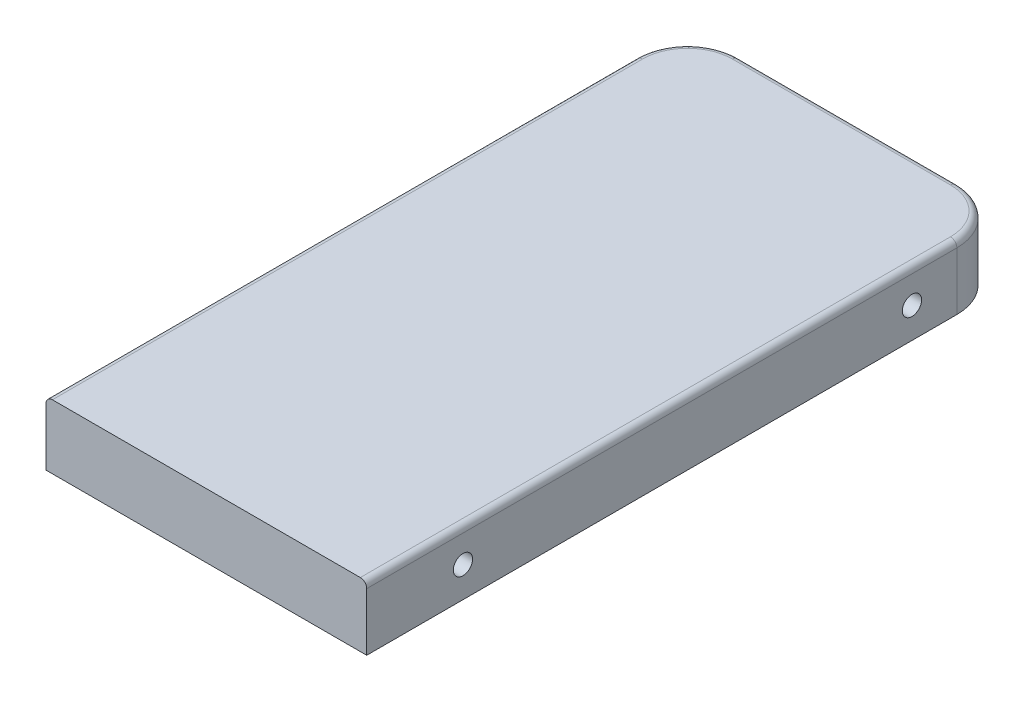
ISO-10303-21;
HEADER;
FILE_DESCRIPTION(('STEP AP214'),'2;1');
FILE_NAME('part.step','',(''),(''),'','','');
FILE_SCHEMA(('AUTOMOTIVE_DESIGN { 1 0 10303 214 1 1 1 1 }'));
ENDSEC;
DATA;
#1=APPLICATION_CONTEXT('core data for automotive mechanical design processes');
#2=APPLICATION_PROTOCOL_DEFINITION('international standard','automotive_design',2000,#1);
#3=PRODUCT_CONTEXT('',#1,'mechanical');
#4=PRODUCT('Part','Part','',(#3));
#5=PRODUCT_RELATED_PRODUCT_CATEGORY('part','',(#4));
#6=PRODUCT_DEFINITION_FORMATION('','',#4);
#7=PRODUCT_DEFINITION_CONTEXT('part definition',#1,'design');
#8=PRODUCT_DEFINITION('design','',#6,#7);
#9=PRODUCT_DEFINITION_SHAPE('','',#8);
#10=(LENGTH_UNIT() NAMED_UNIT(*) SI_UNIT(.MILLI.,.METRE.));
#11=(NAMED_UNIT(*) PLANE_ANGLE_UNIT() SI_UNIT($,.RADIAN.));
#12=(NAMED_UNIT(*) SI_UNIT($,.STERADIAN.) SOLID_ANGLE_UNIT());
#13=UNCERTAINTY_MEASURE_WITH_UNIT(LENGTH_MEASURE(1.E-05),#10,'distance_accuracy_value','');
#14=(GEOMETRIC_REPRESENTATION_CONTEXT(3) GLOBAL_UNCERTAINTY_ASSIGNED_CONTEXT((#13)) GLOBAL_UNIT_ASSIGNED_CONTEXT((#10,
#11,#12)) REPRESENTATION_CONTEXT('',''));
#15=CARTESIAN_POINT('',(0.,0.,0.));
#16=DIRECTION('',(0.,0.,1.));
#17=DIRECTION('',(1.,0.,0.));
#18=AXIS2_PLACEMENT_3D('',#15,#16,#17);
#19=CARTESIAN_POINT('',(0.,100.,0.));
#20=DIRECTION('',(1.,0.,0.));
#21=DIRECTION('',(0.,0.,-1.));
#22=AXIS2_PLACEMENT_3D('',#19,#20,#21);
#23=PLANE('',#22);
#24=CARTESIAN_POINT('',(0.,47.4194012972902,850.));
#25=DIRECTION('',(1.,0.,0.));
#26=DIRECTION('',(0.,0.,-1.));
#27=AXIS2_PLACEMENT_3D('',#24,#25,#26);
#28=CIRCLE('',#27,14.9999999999999);
#29=CARTESIAN_POINT('',(0.,47.4194012972902,835.));
#30=VERTEX_POINT('',#29);
#31=EDGE_CURVE('E128',#30,#30,#28,.T.);
#32=ORIENTED_EDGE('',*,*,#31,.T.);
#33=EDGE_LOOP('',(#32));
#34=FACE_BOUND('',#33,.T.);
#35=CARTESIAN_POINT('',(-1.11022302462516E-13,47.4194012972902,150.));
#36=DIRECTION('',(1.,0.,0.));
#37=DIRECTION('',(0.,0.,-1.));
#38=AXIS2_PLACEMENT_3D('',#35,#36,#37);
#39=CIRCLE('',#38,15.);
#40=CARTESIAN_POINT('',(-1.12687636999453E-13,47.4194012972902,135.));
#41=VERTEX_POINT('',#40);
#42=EDGE_CURVE('E185',#41,#41,#39,.T.);
#43=ORIENTED_EDGE('',*,*,#42,.T.);
#44=EDGE_LOOP('',(#43));
#45=FACE_BOUND('',#44,.T.);
#46=DIRECTION('',(0.,-1.,0.));
#47=VECTOR('',#46,1.);
#48=CARTESIAN_POINT('',(1.22464679914735E-13,100.,1000.));
#49=LINE('',#48,#47);
#50=CARTESIAN_POINT('',(1.22464679914735E-13,90.,1000.));
#51=VERTEX_POINT('',#50);
#52=CARTESIAN_POINT('',(1.22464679914735E-13,0.,1000.));
#53=VERTEX_POINT('',#52);
#54=EDGE_CURVE('E110',#51,#53,#49,.T.);
#55=ORIENTED_EDGE('',*,*,#54,.F.);
#56=DIRECTION('',(0.,0.,1.));
#57=VECTOR('',#56,1.);
#58=CARTESIAN_POINT('',(0.,90.,80.));
#59=LINE('',#58,#57);
#60=CARTESIAN_POINT('',(0.,90.,80.));
#61=VERTEX_POINT('',#60);
#62=EDGE_CURVE('E62',#51,#61,#59,.F.);
#63=ORIENTED_EDGE('',*,*,#62,.T.);
#64=DIRECTION('',(0.,-1.,0.));
#65=VECTOR('',#64,1.);
#66=CARTESIAN_POINT('',(0.,100.,80.));
#67=LINE('',#66,#65);
#68=CARTESIAN_POINT('',(0.,0.,80.));
#69=VERTEX_POINT('',#68);
#70=EDGE_CURVE('E125',#61,#69,#67,.T.);
#71=ORIENTED_EDGE('',*,*,#70,.T.);
#72=DIRECTION('',(0.,0.,1.));
#73=VECTOR('',#72,1.);
#74=CARTESIAN_POINT('',(0.,0.,0.));
#75=LINE('',#74,#73);
#76=EDGE_CURVE('E124',#69,#53,#75,.T.);
#77=ORIENTED_EDGE('',*,*,#76,.T.);
#78=EDGE_LOOP('',(#55,#63,#71,#77));
#79=FACE_BOUND('',#78,.T.);
#80=ADVANCED_FACE('F38',(#34,#45,#79),#23,.F.);
#81=CARTESIAN_POINT('',(1.22464679914735E-13,100.,1000.));
#82=DIRECTION('',(0.,0.,-1.));
#83=DIRECTION('',(-1.,0.,0.));
#84=AXIS2_PLACEMENT_3D('',#81,#82,#83);
#85=PLANE('',#84);
#86=DIRECTION('',(0.,-1.,0.));
#87=VECTOR('',#86,1.);
#88=CARTESIAN_POINT('',(500.,100.,1000.));
#89=LINE('',#88,#87);
#90=CARTESIAN_POINT('',(500.,90.,1000.));
#91=VERTEX_POINT('',#90);
#92=CARTESIAN_POINT('',(500.,0.,1000.));
#93=VERTEX_POINT('',#92);
#94=EDGE_CURVE('E121',#91,#93,#89,.T.);
#95=ORIENTED_EDGE('',*,*,#94,.F.);
#96=CARTESIAN_POINT('',(490.,90.,1000.));
#97=DIRECTION('',(0.,0.,-1.));
#98=DIRECTION('',(-1.,0.,0.));
#99=AXIS2_PLACEMENT_3D('',#96,#97,#98);
#100=CIRCLE('',#99,10.);
#101=CARTESIAN_POINT('',(490.,100.,1000.));
#102=VERTEX_POINT('',#101);
#103=EDGE_CURVE('E168',#91,#102,#100,.F.);
#104=ORIENTED_EDGE('',*,*,#103,.T.);
#105=DIRECTION('',(1.,0.,0.));
#106=VECTOR('',#105,1.);
#107=CARTESIAN_POINT('',(1.22464679914735E-13,100.,1000.));
#108=LINE('',#107,#106);
#109=CARTESIAN_POINT('',(10.0000000000001,100.,1000.));
#110=VERTEX_POINT('',#109);
#111=EDGE_CURVE('E141',#110,#102,#108,.T.);
#112=ORIENTED_EDGE('',*,*,#111,.F.);
#113=CARTESIAN_POINT('',(10.0000000000001,90.,1000.));
#114=DIRECTION('',(0.,0.,-1.));
#115=DIRECTION('',(-1.,0.,0.));
#116=AXIS2_PLACEMENT_3D('',#113,#114,#115);
#117=CIRCLE('',#116,10.);
#118=EDGE_CURVE('E119',#110,#51,#117,.F.);
#119=ORIENTED_EDGE('',*,*,#118,.T.);
#120=ORIENTED_EDGE('',*,*,#54,.T.);
#121=DIRECTION('',(1.,0.,0.));
#122=VECTOR('',#121,1.);
#123=CARTESIAN_POINT('',(1.22464679914735E-13,0.,1000.));
#124=LINE('',#123,#122);
#125=EDGE_CURVE('E115',#53,#93,#124,.T.);
#126=ORIENTED_EDGE('',*,*,#125,.T.);
#127=EDGE_LOOP('',(#95,#104,#112,#119,#120,#126));
#128=FACE_BOUND('',#127,.T.);
#129=ADVANCED_FACE('F113',(#128),#85,.F.);
#130=CARTESIAN_POINT('',(500.,100.,0.));
#131=DIRECTION('',(-1.,0.,0.));
#132=DIRECTION('',(0.,0.,1.));
#133=AXIS2_PLACEMENT_3D('',#130,#131,#132);
#134=PLANE('',#133);
#135=CARTESIAN_POINT('',(500.,47.4194012972902,850.));
#136=DIRECTION('',(1.,0.,0.));
#137=DIRECTION('',(0.,0.,-1.));
#138=AXIS2_PLACEMENT_3D('',#135,#136,#137);
#139=CIRCLE('',#138,14.9999999999999);
#140=CARTESIAN_POINT('',(500.,47.4194012972902,835.));
#141=VERTEX_POINT('',#140);
#142=EDGE_CURVE('E195',#141,#141,#139,.T.);
#143=ORIENTED_EDGE('',*,*,#142,.F.);
#144=EDGE_LOOP('',(#143));
#145=FACE_BOUND('',#144,.T.);
#146=CARTESIAN_POINT('',(500.,47.4194012972902,150.));
#147=DIRECTION('',(1.,0.,0.));
#148=DIRECTION('',(0.,0.,-1.));
#149=AXIS2_PLACEMENT_3D('',#146,#147,#148);
#150=CIRCLE('',#149,15.);
#151=CARTESIAN_POINT('',(500.,47.4194012972902,135.));
#152=VERTEX_POINT('',#151);
#153=EDGE_CURVE('E190',#152,#152,#150,.T.);
#154=ORIENTED_EDGE('',*,*,#153,.F.);
#155=EDGE_LOOP('',(#154));
#156=FACE_BOUND('',#155,.T.);
#157=DIRECTION('',(0.,-1.,0.));
#158=VECTOR('',#157,1.);
#159=CARTESIAN_POINT('',(500.,100.,80.));
#160=LINE('',#159,#158);
#161=CARTESIAN_POINT('',(500.,0.,80.));
#162=VERTEX_POINT('',#161);
#163=CARTESIAN_POINT('',(500.,90.,80.));
#164=VERTEX_POINT('',#163);
#165=EDGE_CURVE('E150',#162,#164,#160,.F.);
#166=ORIENTED_EDGE('',*,*,#165,.T.);
#167=DIRECTION('',(0.,0.,-1.));
#168=VECTOR('',#167,1.);
#169=CARTESIAN_POINT('',(500.,90.,1000.));
#170=LINE('',#169,#168);
#171=EDGE_CURVE('E165',#164,#91,#170,.F.);
#172=ORIENTED_EDGE('',*,*,#171,.T.);
#173=ORIENTED_EDGE('',*,*,#94,.T.);
#174=DIRECTION('',(0.,0.,-1.));
#175=VECTOR('',#174,1.);
#176=CARTESIAN_POINT('',(500.,0.,0.));
#177=LINE('',#176,#175);
#178=EDGE_CURVE('E133',#93,#162,#177,.T.);
#179=ORIENTED_EDGE('',*,*,#178,.T.);
#180=EDGE_LOOP('',(#166,#172,#173,#179));
#181=FACE_BOUND('',#180,.T.);
#182=ADVANCED_FACE('F220',(#145,#156,#181),#134,.F.);
#183=CARTESIAN_POINT('',(0.,100.,0.));
#184=DIRECTION('',(0.,0.,1.));
#185=DIRECTION('',(1.,0.,0.));
#186=AXIS2_PLACEMENT_3D('',#183,#184,#185);
#187=PLANE('',#186);
#188=DIRECTION('',(0.,-1.,0.));
#189=VECTOR('',#188,1.);
#190=CARTESIAN_POINT('',(80.,100.,0.));
#191=LINE('',#190,#189);
#192=CARTESIAN_POINT('',(80.,0.,0.));
#193=VERTEX_POINT('',#192);
#194=CARTESIAN_POINT('',(80.,90.,0.));
#195=VERTEX_POINT('',#194);
#196=EDGE_CURVE('E120',#193,#195,#191,.F.);
#197=ORIENTED_EDGE('',*,*,#196,.T.);
#198=DIRECTION('',(-1.,0.,0.));
#199=VECTOR('',#198,1.);
#200=CARTESIAN_POINT('',(420.,90.,0.));
#201=LINE('',#200,#199);
#202=CARTESIAN_POINT('',(420.,90.,0.));
#203=VERTEX_POINT('',#202);
#204=EDGE_CURVE('E11',#195,#203,#201,.F.);
#205=ORIENTED_EDGE('',*,*,#204,.T.);
#206=DIRECTION('',(0.,-1.,0.));
#207=VECTOR('',#206,1.);
#208=CARTESIAN_POINT('',(420.,100.,0.));
#209=LINE('',#208,#207);
#210=CARTESIAN_POINT('',(420.,0.,0.));
#211=VERTEX_POINT('',#210);
#212=EDGE_CURVE('E144',#203,#211,#209,.T.);
#213=ORIENTED_EDGE('',*,*,#212,.T.);
#214=DIRECTION('',(-1.,0.,0.));
#215=VECTOR('',#214,1.);
#216=CARTESIAN_POINT('',(0.,0.,0.));
#217=LINE('',#216,#215);
#218=EDGE_CURVE('E135',#211,#193,#217,.T.);
#219=ORIENTED_EDGE('',*,*,#218,.T.);
#220=EDGE_LOOP('',(#197,#205,#213,#219));
#221=FACE_BOUND('',#220,.T.);
#222=ADVANCED_FACE('F222',(#221),#187,.F.);
#223=CARTESIAN_POINT('',(0.,100.,0.));
#224=DIRECTION('',(0.,1.,0.));
#225=DIRECTION('',(0.,0.,1.));
#226=AXIS2_PLACEMENT_3D('',#223,#224,#225);
#227=PLANE('',#226);
#228=ORIENTED_EDGE('',*,*,#111,.T.);
#229=DIRECTION('',(0.,0.,-1.));
#230=VECTOR('',#229,1.);
#231=CARTESIAN_POINT('',(490.,100.,80.));
#232=LINE('',#231,#230);
#233=CARTESIAN_POINT('',(490.,100.,80.));
#234=VERTEX_POINT('',#233);
#235=EDGE_CURVE('E162',#102,#234,#232,.T.);
#236=ORIENTED_EDGE('',*,*,#235,.T.);
#237=CARTESIAN_POINT('',(420.,100.,80.));
#238=DIRECTION('',(0.,1.,0.));
#239=DIRECTION('',(0.,0.,1.));
#240=AXIS2_PLACEMENT_3D('',#237,#238,#239);
#241=CIRCLE('',#240,70.);
#242=CARTESIAN_POINT('',(420.,100.,10.));
#243=VERTEX_POINT('',#242);
#244=EDGE_CURVE('E160',#234,#243,#241,.T.);
#245=ORIENTED_EDGE('',*,*,#244,.T.);
#246=DIRECTION('',(-1.,0.,0.));
#247=VECTOR('',#246,1.);
#248=CARTESIAN_POINT('',(80.,100.,10.));
#249=LINE('',#248,#247);
#250=CARTESIAN_POINT('',(80.,100.,10.));
#251=VERTEX_POINT('',#250);
#252=EDGE_CURVE('E154',#243,#251,#249,.T.);
#253=ORIENTED_EDGE('',*,*,#252,.T.);
#254=CARTESIAN_POINT('',(80.,100.,80.));
#255=DIRECTION('',(0.,1.,0.));
#256=DIRECTION('',(0.,0.,1.));
#257=AXIS2_PLACEMENT_3D('',#254,#255,#256);
#258=CIRCLE('',#257,70.);
#259=CARTESIAN_POINT('',(10.,100.,80.));
#260=VERTEX_POINT('',#259);
#261=EDGE_CURVE('E156',#251,#260,#258,.T.);
#262=ORIENTED_EDGE('',*,*,#261,.T.);
#263=DIRECTION('',(0.,0.,1.));
#264=VECTOR('',#263,1.);
#265=CARTESIAN_POINT('',(10.0000000000001,100.,1000.));
#266=LINE('',#265,#264);
#267=EDGE_CURVE('E158',#260,#110,#266,.T.);
#268=ORIENTED_EDGE('',*,*,#267,.T.);
#269=EDGE_LOOP('',(#228,#236,#245,#253,#262,#268));
#270=FACE_BOUND('',#269,.T.);
#271=ADVANCED_FACE('F201',(#270),#227,.T.);
#272=CARTESIAN_POINT('',(0.,0.,0.));
#273=DIRECTION('',(0.,1.,0.));
#274=DIRECTION('',(0.,0.,1.));
#275=AXIS2_PLACEMENT_3D('',#272,#273,#274);
#276=PLANE('',#275);
#277=ORIENTED_EDGE('',*,*,#218,.F.);
#278=CARTESIAN_POINT('',(420.,0.,80.));
#279=DIRECTION('',(0.,1.,0.));
#280=DIRECTION('',(0.,0.,1.));
#281=AXIS2_PLACEMENT_3D('',#278,#279,#280);
#282=CIRCLE('',#281,80.);
#283=EDGE_CURVE('E148',#211,#162,#282,.F.);
#284=ORIENTED_EDGE('',*,*,#283,.T.);
#285=ORIENTED_EDGE('',*,*,#178,.F.);
#286=ORIENTED_EDGE('',*,*,#125,.F.);
#287=ORIENTED_EDGE('',*,*,#76,.F.);
#288=CARTESIAN_POINT('',(80.,0.,80.));
#289=DIRECTION('',(0.,1.,0.));
#290=DIRECTION('',(0.,0.,1.));
#291=AXIS2_PLACEMENT_3D('',#288,#289,#290);
#292=CIRCLE('',#291,80.);
#293=EDGE_CURVE('E146',#69,#193,#292,.F.);
#294=ORIENTED_EDGE('',*,*,#293,.T.);
#295=EDGE_LOOP('',(#277,#284,#285,#286,#287,#294));
#296=FACE_BOUND('',#295,.T.);
#297=ADVANCED_FACE('F131',(#296),#276,.F.);
#298=CARTESIAN_POINT('',(-1.11022302462516E-13,47.4194012972902,150.));
#299=DIRECTION('',(1.,0.,0.));
#300=DIRECTION('',(0.,0.,-1.));
#301=AXIS2_PLACEMENT_3D('',#298,#299,#300);
#302=CYLINDRICAL_SURFACE('',#301,15.);
#303=ORIENTED_EDGE('',*,*,#42,.F.);
#304=EDGE_LOOP('',(#303));
#305=FACE_BOUND('',#304,.T.);
#306=ORIENTED_EDGE('',*,*,#153,.T.);
#307=EDGE_LOOP('',(#306));
#308=FACE_BOUND('',#307,.T.);
#309=ADVANCED_FACE('F307',(#305,#308),#302,.F.);
#310=CARTESIAN_POINT('',(0.,47.4194012972902,850.));
#311=DIRECTION('',(1.,0.,0.));
#312=DIRECTION('',(0.,0.,-1.));
#313=AXIS2_PLACEMENT_3D('',#310,#311,#312);
#314=CYLINDRICAL_SURFACE('',#313,14.9999999999999);
#315=ORIENTED_EDGE('',*,*,#31,.F.);
#316=EDGE_LOOP('',(#315));
#317=FACE_BOUND('',#316,.T.);
#318=ORIENTED_EDGE('',*,*,#142,.T.);
#319=EDGE_LOOP('',(#318));
#320=FACE_BOUND('',#319,.T.);
#321=ADVANCED_FACE('F245',(#317,#320),#314,.F.);
#322=CARTESIAN_POINT('',(420.,100.,80.));
#323=DIRECTION('',(0.,-1.,0.));
#324=DIRECTION('',(0.,0.,-1.));
#325=AXIS2_PLACEMENT_3D('',#322,#323,#324);
#326=CYLINDRICAL_SURFACE('',#325,80.);
#327=ORIENTED_EDGE('',*,*,#212,.F.);
#328=CARTESIAN_POINT('',(420.,90.,80.));
#329=DIRECTION('',(0.,1.,0.));
#330=DIRECTION('',(0.,0.,1.));
#331=AXIS2_PLACEMENT_3D('',#328,#329,#330);
#332=CIRCLE('',#331,80.);
#333=EDGE_CURVE('E170',#203,#164,#332,.F.);
#334=ORIENTED_EDGE('',*,*,#333,.T.);
#335=ORIENTED_EDGE('',*,*,#165,.F.);
#336=ORIENTED_EDGE('',*,*,#283,.F.);
#337=EDGE_LOOP('',(#327,#334,#335,#336));
#338=FACE_BOUND('',#337,.T.);
#339=ADVANCED_FACE('F217',(#338),#326,.T.);
#340=CARTESIAN_POINT('',(80.,100.,80.));
#341=DIRECTION('',(0.,-1.,0.));
#342=DIRECTION('',(0.,0.,-1.));
#343=AXIS2_PLACEMENT_3D('',#340,#341,#342);
#344=CYLINDRICAL_SURFACE('',#343,80.);
#345=ORIENTED_EDGE('',*,*,#70,.F.);
#346=CARTESIAN_POINT('',(80.,90.,80.));
#347=DIRECTION('',(0.,1.,0.));
#348=DIRECTION('',(0.,0.,1.));
#349=AXIS2_PLACEMENT_3D('',#346,#347,#348);
#350=CIRCLE('',#349,80.);
#351=EDGE_CURVE('E47',#61,#195,#350,.F.);
#352=ORIENTED_EDGE('',*,*,#351,.T.);
#353=ORIENTED_EDGE('',*,*,#196,.F.);
#354=ORIENTED_EDGE('',*,*,#293,.F.);
#355=EDGE_LOOP('',(#345,#352,#353,#354));
#356=FACE_BOUND('',#355,.T.);
#357=ADVANCED_FACE('F244',(#356),#344,.T.);
#358=CARTESIAN_POINT('',(10.,90.,0.));
#359=DIRECTION('',(0.,0.,-1.));
#360=DIRECTION('',(-1.,0.,0.));
#361=AXIS2_PLACEMENT_3D('',#358,#359,#360);
#362=CYLINDRICAL_SURFACE('',#361,10.);
#363=ORIENTED_EDGE('',*,*,#118,.F.);
#364=ORIENTED_EDGE('',*,*,#267,.F.);
#365=CARTESIAN_POINT('',(10.,90.,80.));
#366=DIRECTION('',(0.,0.,-1.));
#367=DIRECTION('',(-1.,0.,0.));
#368=AXIS2_PLACEMENT_3D('',#365,#366,#367);
#369=CIRCLE('',#368,10.);
#370=EDGE_CURVE('E42',#61,#260,#369,.T.);
#371=ORIENTED_EDGE('',*,*,#370,.F.);
#372=ORIENTED_EDGE('',*,*,#62,.F.);
#373=EDGE_LOOP('',(#363,#364,#371,#372));
#374=FACE_BOUND('',#373,.T.);
#375=ADVANCED_FACE('F40',(#374),#362,.T.);
#376=CARTESIAN_POINT('',(80.,90.,80.));
#377=DIRECTION('',(0.,1.,0.));
#378=DIRECTION('',(0.,0.,1.));
#379=AXIS2_PLACEMENT_3D('',#376,#377,#378);
#380=TOROIDAL_SURFACE('',#379,70.,10.);
#381=ORIENTED_EDGE('',*,*,#370,.T.);
#382=ORIENTED_EDGE('',*,*,#261,.F.);
#383=CARTESIAN_POINT('',(80.,90.,10.));
#384=DIRECTION('',(1.,0.,0.));
#385=DIRECTION('',(0.,0.,-1.));
#386=AXIS2_PLACEMENT_3D('',#383,#384,#385);
#387=CIRCLE('',#386,10.);
#388=EDGE_CURVE('E178',#195,#251,#387,.T.);
#389=ORIENTED_EDGE('',*,*,#388,.F.);
#390=ORIENTED_EDGE('',*,*,#351,.F.);
#391=EDGE_LOOP('',(#381,#382,#389,#390));
#392=FACE_BOUND('',#391,.T.);
#393=ADVANCED_FACE('F253',(#392),#380,.T.);
#394=CARTESIAN_POINT('',(0.,90.,10.));
#395=DIRECTION('',(1.,0.,0.));
#396=DIRECTION('',(0.,0.,-1.));
#397=AXIS2_PLACEMENT_3D('',#394,#395,#396);
#398=CYLINDRICAL_SURFACE('',#397,10.);
#399=ORIENTED_EDGE('',*,*,#388,.T.);
#400=ORIENTED_EDGE('',*,*,#252,.F.);
#401=CARTESIAN_POINT('',(420.,90.,10.));
#402=DIRECTION('',(1.,0.,0.));
#403=DIRECTION('',(0.,0.,-1.));
#404=AXIS2_PLACEMENT_3D('',#401,#402,#403);
#405=CIRCLE('',#404,10.);
#406=EDGE_CURVE('E176',#203,#243,#405,.T.);
#407=ORIENTED_EDGE('',*,*,#406,.F.);
#408=ORIENTED_EDGE('',*,*,#204,.F.);
#409=EDGE_LOOP('',(#399,#400,#407,#408));
#410=FACE_BOUND('',#409,.T.);
#411=ADVANCED_FACE('F213',(#410),#398,.T.);
#412=CARTESIAN_POINT('',(420.,90.,80.));
#413=DIRECTION('',(0.,1.,0.));
#414=DIRECTION('',(0.,0.,1.));
#415=AXIS2_PLACEMENT_3D('',#412,#413,#414);
#416=TOROIDAL_SURFACE('',#415,70.,10.);
#417=ORIENTED_EDGE('',*,*,#406,.T.);
#418=ORIENTED_EDGE('',*,*,#244,.F.);
#419=CARTESIAN_POINT('',(490.,90.,80.));
#420=DIRECTION('',(0.,0.,1.));
#421=DIRECTION('',(1.,0.,0.));
#422=AXIS2_PLACEMENT_3D('',#419,#420,#421);
#423=CIRCLE('',#422,10.);
#424=EDGE_CURVE('E174',#164,#234,#423,.T.);
#425=ORIENTED_EDGE('',*,*,#424,.F.);
#426=ORIENTED_EDGE('',*,*,#333,.F.);
#427=EDGE_LOOP('',(#417,#418,#425,#426));
#428=FACE_BOUND('',#427,.T.);
#429=ADVANCED_FACE('F211',(#428),#416,.T.);
#430=CARTESIAN_POINT('',(490.,90.,0.));
#431=DIRECTION('',(0.,0.,1.));
#432=DIRECTION('',(1.,0.,0.));
#433=AXIS2_PLACEMENT_3D('',#430,#431,#432);
#434=CYLINDRICAL_SURFACE('',#433,10.);
#435=ORIENTED_EDGE('',*,*,#103,.F.);
#436=ORIENTED_EDGE('',*,*,#171,.F.);
#437=ORIENTED_EDGE('',*,*,#424,.T.);
#438=ORIENTED_EDGE('',*,*,#235,.F.);
#439=EDGE_LOOP('',(#435,#436,#437,#438));
#440=FACE_BOUND('',#439,.T.);
#441=ADVANCED_FACE('F205',(#440),#434,.T.);
#442=CLOSED_SHELL('',(#80,#129,#182,#222,#271,#297,#309,#321,#339,#357,#375,#393,#411,#429,#441));
#443=MANIFOLD_SOLID_BREP('B2',#442);
#444=ADVANCED_BREP_SHAPE_REPRESENTATION('',(#18,#443),#14);
#445=SHAPE_DEFINITION_REPRESENTATION(#9,#444);
ENDSEC;
END-ISO-10303-21;
